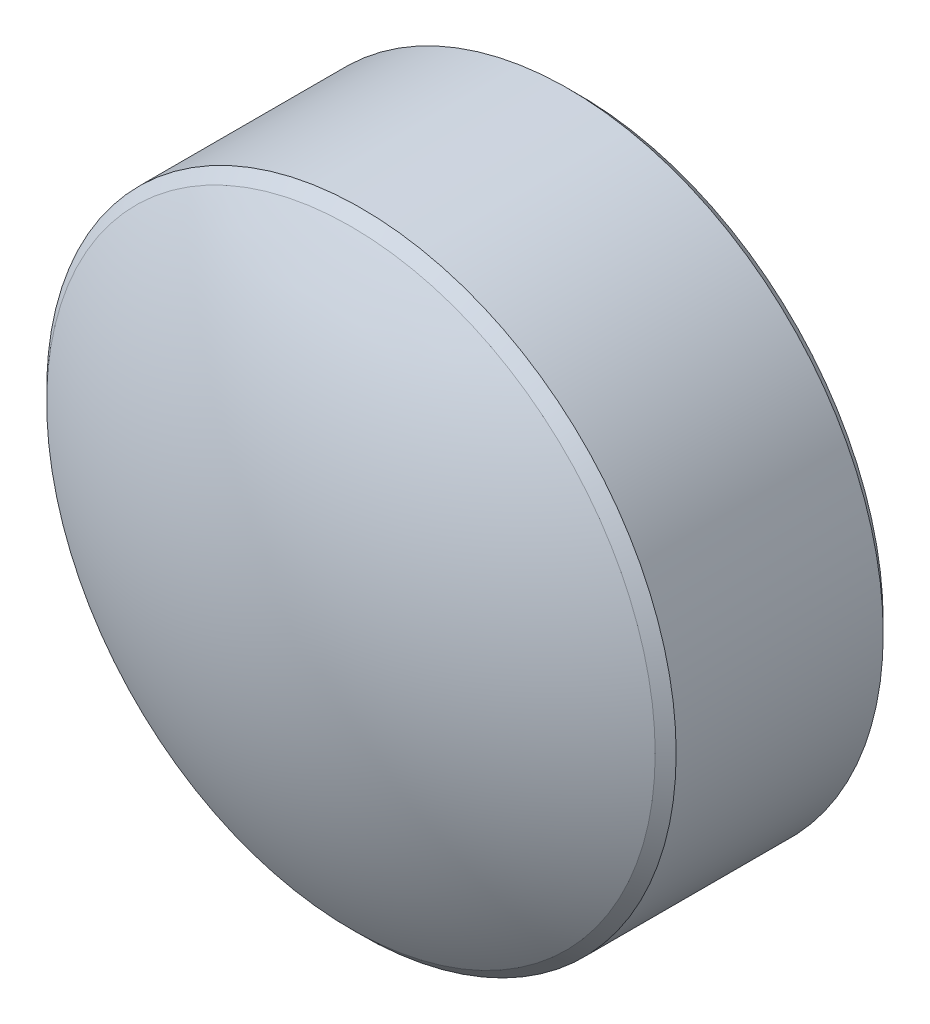
ISO-10303-21;
HEADER;
FILE_DESCRIPTION(('STEP AP214'),'2;1');
FILE_NAME('part.step','',(''),(''),'','','');
FILE_SCHEMA(('AUTOMOTIVE_DESIGN { 1 0 10303 214 1 1 1 1 }'));
ENDSEC;
DATA;
#1=APPLICATION_CONTEXT('core data for automotive mechanical design processes');
#2=APPLICATION_PROTOCOL_DEFINITION('international standard','automotive_design',2000,#1);
#3=PRODUCT_CONTEXT('',#1,'mechanical');
#4=PRODUCT('Part','Part','',(#3));
#5=PRODUCT_RELATED_PRODUCT_CATEGORY('part','',(#4));
#6=PRODUCT_DEFINITION_FORMATION('','',#4);
#7=PRODUCT_DEFINITION_CONTEXT('part definition',#1,'design');
#8=PRODUCT_DEFINITION('design','',#6,#7);
#9=PRODUCT_DEFINITION_SHAPE('','',#8);
#10=(LENGTH_UNIT() NAMED_UNIT(*) SI_UNIT(.MILLI.,.METRE.));
#11=(NAMED_UNIT(*) PLANE_ANGLE_UNIT() SI_UNIT($,.RADIAN.));
#12=(NAMED_UNIT(*) SI_UNIT($,.STERADIAN.) SOLID_ANGLE_UNIT());
#13=UNCERTAINTY_MEASURE_WITH_UNIT(LENGTH_MEASURE(1.E-05),#10,'distance_accuracy_value','');
#14=(GEOMETRIC_REPRESENTATION_CONTEXT(3) GLOBAL_UNCERTAINTY_ASSIGNED_CONTEXT((#13)) GLOBAL_UNIT_ASSIGNED_CONTEXT((#10,
#11,#12)) REPRESENTATION_CONTEXT('',''));
#15=CARTESIAN_POINT('',(0.,0.,0.));
#16=DIRECTION('',(0.,0.,1.));
#17=DIRECTION('',(1.,0.,0.));
#18=AXIS2_PLACEMENT_3D('',#15,#16,#17);
#19=CARTESIAN_POINT('',(1.13392654018935,1.46736551518672,1.61202730254879));
#20=DIRECTION('',(0.,0.,1.));
#21=DIRECTION('',(1.,0.,0.));
#22=AXIS2_PLACEMENT_3D('',#19,#20,#21);
#23=PLANE('',#22);
#24=CARTESIAN_POINT('',(1.13392654018935,1.46736551518672,1.61202730254879));
#25=DIRECTION('',(0.,0.,1.));
#26=DIRECTION('',(1.,0.,0.));
#27=AXIS2_PLACEMENT_3D('',#24,#25,#26);
#28=CIRCLE('',#27,1.45);
#29=CARTESIAN_POINT('',(2.58392654018935,1.46736551518672,1.61202730254879));
#30=VERTEX_POINT('',#29);
#31=EDGE_CURVE('E9',#30,#30,#28,.F.);
#32=ORIENTED_EDGE('',*,*,#31,.T.);
#33=EDGE_LOOP('',(#32));
#34=FACE_BOUND('',#33,.T.);
#35=ADVANCED_FACE('F13',(#34),#23,.F.);
#36=CARTESIAN_POINT('',(1.13392654018935,1.46736551518672,3.11202730254879));
#37=DIRECTION('',(0.,0.,1.));
#38=DIRECTION('',(1.,0.,0.));
#39=AXIS2_PLACEMENT_3D('',#36,#37,#38);
#40=CYLINDRICAL_SURFACE('',#39,1.5);
#41=CARTESIAN_POINT('',(1.13392654018935,1.46736551518672,1.66202730254879));
#42=DIRECTION('',(0.,0.,1.));
#43=DIRECTION('',(1.,0.,0.));
#44=AXIS2_PLACEMENT_3D('',#41,#42,#43);
#45=CIRCLE('',#44,1.5);
#46=CARTESIAN_POINT('',(2.63392654018935,1.46736551518672,1.66202730254879));
#47=VERTEX_POINT('',#46);
#48=EDGE_CURVE('E20',#47,#47,#45,.T.);
#49=ORIENTED_EDGE('',*,*,#48,.T.);
#50=EDGE_LOOP('',(#49));
#51=FACE_BOUND('',#50,.T.);
#52=CARTESIAN_POINT('',(1.13392654018935,1.46736551518672,2.64886840065619));
#53=DIRECTION('',(0.,0.,1.));
#54=DIRECTION('',(1.,0.,0.));
#55=AXIS2_PLACEMENT_3D('',#52,#53,#54);
#56=CIRCLE('',#55,1.5);
#57=CARTESIAN_POINT('',(2.63392654018935,1.46736551518672,2.64886840065619));
#58=VERTEX_POINT('',#57);
#59=EDGE_CURVE('E24',#58,#58,#56,.T.);
#60=ORIENTED_EDGE('',*,*,#59,.F.);
#61=EDGE_LOOP('',(#60));
#62=FACE_BOUND('',#61,.T.);
#63=ADVANCED_FACE('F39',(#51,#62),#40,.T.);
#64=CARTESIAN_POINT('',(1.13392654018935,1.46736551518672,2.64886840065619));
#65=DIRECTION('',(0.,0.,-1.));
#66=DIRECTION('',(-1.,0.,0.));
#67=AXIS2_PLACEMENT_3D('',#64,#65,#66);
#68=CONICAL_SURFACE('',#67,1.5,0.785398163397444);
#69=CARTESIAN_POINT('',(1.13392654018935,1.46736551518672,2.69886840065619));
#70=DIRECTION('',(0.,0.,1.));
#71=DIRECTION('',(1.,0.,0.));
#72=AXIS2_PLACEMENT_3D('',#69,#70,#71);
#73=CIRCLE('',#72,1.45);
#74=CARTESIAN_POINT('',(2.58392654018935,1.46736551518672,2.69886840065619));
#75=VERTEX_POINT('',#74);
#76=EDGE_CURVE('E28',#75,#75,#73,.T.);
#77=ORIENTED_EDGE('',*,*,#76,.F.);
#78=EDGE_LOOP('',(#77));
#79=FACE_BOUND('',#78,.T.);
#80=ORIENTED_EDGE('',*,*,#59,.T.);
#81=EDGE_LOOP('',(#80));
#82=FACE_BOUND('',#81,.T.);
#83=ADVANCED_FACE('F36',(#79,#82),#68,.T.);
#84=CARTESIAN_POINT('',(1.13392654018935,1.46736551518672,0.36102730254879));
#85=DIRECTION('',(0.,0.,1.));
#86=DIRECTION('',(0.,1.,0.));
#87=AXIS2_PLACEMENT_3D('',#84,#85,#86);
#88=SPHERICAL_SURFACE('',#87,2.751);
#89=ORIENTED_EDGE('',*,*,#76,.T.);
#90=EDGE_LOOP('',(#89));
#91=FACE_BOUND('',#90,.T.);
#92=ADVANCED_FACE('F34',(#91),#88,.T.);
#93=CARTESIAN_POINT('',(1.13392654018935,1.46736551518672,1.66202730254879));
#94=DIRECTION('',(0.,0.,1.));
#95=DIRECTION('',(1.,0.,0.));
#96=AXIS2_PLACEMENT_3D('',#93,#94,#95);
#97=CONICAL_SURFACE('',#96,1.5,0.785398163397438);
#98=ORIENTED_EDGE('',*,*,#31,.F.);
#99=EDGE_LOOP('',(#98));
#100=FACE_BOUND('',#99,.T.);
#101=ORIENTED_EDGE('',*,*,#48,.F.);
#102=EDGE_LOOP('',(#101));
#103=FACE_BOUND('',#102,.T.);
#104=ADVANCED_FACE('F15',(#100,#103),#97,.T.);
#105=CLOSED_SHELL('',(#35,#63,#83,#92,#104));
#106=MANIFOLD_SOLID_BREP('B1',#105);
#107=ADVANCED_BREP_SHAPE_REPRESENTATION('',(#18,#106),#14);
#108=SHAPE_DEFINITION_REPRESENTATION(#9,#107);
ENDSEC;
END-ISO-10303-21;
